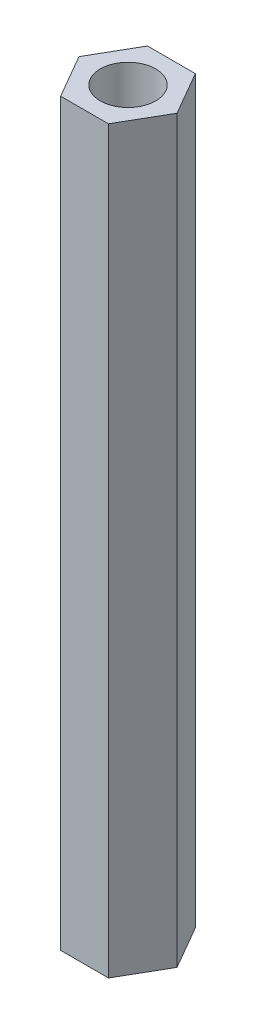
ISO-10303-21;
HEADER;
FILE_DESCRIPTION(('STEP AP214'),'2;1');
FILE_NAME('part.step','',(''),(''),'','','');
FILE_SCHEMA(('AUTOMOTIVE_DESIGN { 1 0 10303 214 1 1 1 1 }'));
ENDSEC;
DATA;
#1=APPLICATION_CONTEXT('core data for automotive mechanical design processes');
#2=APPLICATION_PROTOCOL_DEFINITION('international standard','automotive_design',2000,#1);
#3=PRODUCT_CONTEXT('',#1,'mechanical');
#4=PRODUCT('Part','Part','',(#3));
#5=PRODUCT_RELATED_PRODUCT_CATEGORY('part','',(#4));
#6=PRODUCT_DEFINITION_FORMATION('','',#4);
#7=PRODUCT_DEFINITION_CONTEXT('part definition',#1,'design');
#8=PRODUCT_DEFINITION('design','',#6,#7);
#9=PRODUCT_DEFINITION_SHAPE('','',#8);
#10=(LENGTH_UNIT() NAMED_UNIT(*) SI_UNIT(.MILLI.,.METRE.));
#11=(NAMED_UNIT(*) PLANE_ANGLE_UNIT() SI_UNIT($,.RADIAN.));
#12=(NAMED_UNIT(*) SI_UNIT($,.STERADIAN.) SOLID_ANGLE_UNIT());
#13=UNCERTAINTY_MEASURE_WITH_UNIT(LENGTH_MEASURE(1.E-05),#10,'distance_accuracy_value','');
#14=(GEOMETRIC_REPRESENTATION_CONTEXT(3) GLOBAL_UNCERTAINTY_ASSIGNED_CONTEXT((#13)) GLOBAL_UNIT_ASSIGNED_CONTEXT((#10,
#11,#12)) REPRESENTATION_CONTEXT('',''));
#15=CARTESIAN_POINT('',(0.,0.,0.));
#16=DIRECTION('',(0.,0.,1.));
#17=DIRECTION('',(1.,0.,0.));
#18=AXIS2_PLACEMENT_3D('',#15,#16,#17);
#19=CARTESIAN_POINT('',(0.,40.,0.));
#20=DIRECTION('',(0.,1.,0.));
#21=DIRECTION('',(0.,0.,1.));
#22=AXIS2_PLACEMENT_3D('',#19,#20,#21);
#23=PLANE('',#22);
#24=DIRECTION('',(0.499999999999998,0.,0.86602540378444));
#25=VECTOR('',#24,1.);
#26=CARTESIAN_POINT('',(-1.29322686740439,40.,2.35));
#27=LINE('',#26,#25);
#28=CARTESIAN_POINT('',(-2.65,40.,0.));
#29=VERTEX_POINT('',#28);
#30=CARTESIAN_POINT('',(-1.29322686740439,40.,2.35));
#31=VERTEX_POINT('',#30);
#32=EDGE_CURVE('E146',#29,#31,#27,.T.);
#33=ORIENTED_EDGE('',*,*,#32,.T.);
#34=DIRECTION('',(1.,0.,0.));
#35=VECTOR('',#34,1.);
#36=CARTESIAN_POINT('',(1.29322686740439,40.,2.35));
#37=LINE('',#36,#35);
#38=CARTESIAN_POINT('',(1.29322686740439,40.,2.35));
#39=VERTEX_POINT('',#38);
#40=EDGE_CURVE('E94',#31,#39,#37,.T.);
#41=ORIENTED_EDGE('',*,*,#40,.T.);
#42=DIRECTION('',(0.499999999999998,0.,-0.86602540378444));
#43=VECTOR('',#42,1.);
#44=CARTESIAN_POINT('',(1.29322686740439,40.,2.35));
#45=LINE('',#44,#43);
#46=CARTESIAN_POINT('',(2.65,40.,0.));
#47=VERTEX_POINT('',#46);
#48=EDGE_CURVE('E107',#39,#47,#45,.T.);
#49=ORIENTED_EDGE('',*,*,#48,.T.);
#50=DIRECTION('',(-0.499999999999998,0.,-0.86602540378444));
#51=VECTOR('',#50,1.);
#52=CARTESIAN_POINT('',(1.29322686740439,40.,-2.35));
#53=LINE('',#52,#51);
#54=CARTESIAN_POINT('',(1.29322686740439,40.,-2.35));
#55=VERTEX_POINT('',#54);
#56=EDGE_CURVE('E101',#47,#55,#53,.T.);
#57=ORIENTED_EDGE('',*,*,#56,.T.);
#58=DIRECTION('',(-1.,0.,0.));
#59=VECTOR('',#58,1.);
#60=CARTESIAN_POINT('',(1.29322686740439,40.,-2.35));
#61=LINE('',#60,#59);
#62=CARTESIAN_POINT('',(-1.29322686740439,40.,-2.35));
#63=VERTEX_POINT('',#62);
#64=EDGE_CURVE('E105',#55,#63,#61,.T.);
#65=ORIENTED_EDGE('',*,*,#64,.T.);
#66=DIRECTION('',(-0.499999999999998,0.,0.86602540378444));
#67=VECTOR('',#66,1.);
#68=CARTESIAN_POINT('',(-1.29322686740439,40.,-2.35));
#69=LINE('',#68,#67);
#70=EDGE_CURVE('E57',#63,#29,#69,.T.);
#71=ORIENTED_EDGE('',*,*,#70,.T.);
#72=EDGE_LOOP('',(#33,#41,#49,#57,#65,#71));
#73=FACE_BOUND('',#72,.T.);
#74=CARTESIAN_POINT('',(0.,40.,0.));
#75=DIRECTION('',(0.,1.,0.));
#76=DIRECTION('',(0.,0.,1.));
#77=AXIS2_PLACEMENT_3D('',#74,#75,#76);
#78=CIRCLE('',#77,1.5);
#79=CARTESIAN_POINT('',(0.,40.,1.5));
#80=VERTEX_POINT('',#79);
#81=EDGE_CURVE('E134',#80,#80,#78,.T.);
#82=ORIENTED_EDGE('',*,*,#81,.F.);
#83=EDGE_LOOP('',(#82));
#84=FACE_BOUND('',#83,.T.);
#85=ADVANCED_FACE('F39',(#73,#84),#23,.T.);
#86=CARTESIAN_POINT('',(0.,0.,0.));
#87=DIRECTION('',(0.,1.,0.));
#88=DIRECTION('',(0.,0.,1.));
#89=AXIS2_PLACEMENT_3D('',#86,#87,#88);
#90=PLANE('',#89);
#91=DIRECTION('',(0.499999999999998,0.,0.86602540378444));
#92=VECTOR('',#91,1.);
#93=CARTESIAN_POINT('',(-1.29322686740439,0.,2.35));
#94=LINE('',#93,#92);
#95=CARTESIAN_POINT('',(-2.65,0.,0.));
#96=VERTEX_POINT('',#95);
#97=CARTESIAN_POINT('',(-1.29322686740439,0.,2.35));
#98=VERTEX_POINT('',#97);
#99=EDGE_CURVE('E129',#96,#98,#94,.T.);
#100=ORIENTED_EDGE('',*,*,#99,.F.);
#101=DIRECTION('',(-0.499999999999998,0.,0.86602540378444));
#102=VECTOR('',#101,1.);
#103=CARTESIAN_POINT('',(-1.29322686740439,0.,-2.35));
#104=LINE('',#103,#102);
#105=CARTESIAN_POINT('',(-1.29322686740439,0.,-2.35));
#106=VERTEX_POINT('',#105);
#107=EDGE_CURVE('E86',#106,#96,#104,.T.);
#108=ORIENTED_EDGE('',*,*,#107,.F.);
#109=DIRECTION('',(-1.,0.,0.));
#110=VECTOR('',#109,1.);
#111=CARTESIAN_POINT('',(1.29322686740439,0.,-2.35));
#112=LINE('',#111,#110);
#113=CARTESIAN_POINT('',(1.29322686740439,0.,-2.35));
#114=VERTEX_POINT('',#113);
#115=EDGE_CURVE('E80',#114,#106,#112,.T.);
#116=ORIENTED_EDGE('',*,*,#115,.F.);
#117=DIRECTION('',(-0.499999999999998,0.,-0.86602540378444));
#118=VECTOR('',#117,1.);
#119=CARTESIAN_POINT('',(1.29322686740439,0.,-2.35));
#120=LINE('',#119,#118);
#121=CARTESIAN_POINT('',(2.65,0.,0.));
#122=VERTEX_POINT('',#121);
#123=EDGE_CURVE('E116',#122,#114,#120,.T.);
#124=ORIENTED_EDGE('',*,*,#123,.F.);
#125=DIRECTION('',(0.499999999999998,0.,-0.86602540378444));
#126=VECTOR('',#125,1.);
#127=CARTESIAN_POINT('',(1.29322686740439,0.,2.35));
#128=LINE('',#127,#126);
#129=CARTESIAN_POINT('',(1.29322686740439,0.,2.35));
#130=VERTEX_POINT('',#129);
#131=EDGE_CURVE('E137',#130,#122,#128,.T.);
#132=ORIENTED_EDGE('',*,*,#131,.F.);
#133=DIRECTION('',(1.,0.,0.));
#134=VECTOR('',#133,1.);
#135=CARTESIAN_POINT('',(1.29322686740439,0.,2.35));
#136=LINE('',#135,#134);
#137=EDGE_CURVE('E133',#98,#130,#136,.T.);
#138=ORIENTED_EDGE('',*,*,#137,.F.);
#139=EDGE_LOOP('',(#100,#108,#116,#124,#132,#138));
#140=FACE_BOUND('',#139,.T.);
#141=CARTESIAN_POINT('',(0.,0.,0.));
#142=DIRECTION('',(0.,1.,0.));
#143=DIRECTION('',(0.,0.,1.));
#144=AXIS2_PLACEMENT_3D('',#141,#142,#143);
#145=CIRCLE('',#144,1.5);
#146=CARTESIAN_POINT('',(0.,0.,1.5));
#147=VERTEX_POINT('',#146);
#148=EDGE_CURVE('E243',#147,#147,#145,.T.);
#149=ORIENTED_EDGE('',*,*,#148,.T.);
#150=EDGE_LOOP('',(#149));
#151=FACE_BOUND('',#150,.T.);
#152=ADVANCED_FACE('F159',(#140,#151),#90,.F.);
#153=CARTESIAN_POINT('',(-1.29322686740439,40.,2.35));
#154=DIRECTION('',(0.86602540378444,0.,-0.499999999999998));
#155=DIRECTION('',(-0.499999999999998,0.,-0.86602540378444));
#156=AXIS2_PLACEMENT_3D('',#153,#154,#155);
#157=PLANE('',#156);
#158=ORIENTED_EDGE('',*,*,#99,.T.);
#159=DIRECTION('',(0.,-1.,0.));
#160=VECTOR('',#159,1.);
#161=CARTESIAN_POINT('',(-1.29322686740439,40.,2.35));
#162=LINE('',#161,#160);
#163=EDGE_CURVE('E11',#31,#98,#162,.T.);
#164=ORIENTED_EDGE('',*,*,#163,.F.);
#165=ORIENTED_EDGE('',*,*,#32,.F.);
#166=DIRECTION('',(0.,-1.,0.));
#167=VECTOR('',#166,1.);
#168=CARTESIAN_POINT('',(-2.65,40.,0.));
#169=LINE('',#168,#167);
#170=EDGE_CURVE('E125',#29,#96,#169,.T.);
#171=ORIENTED_EDGE('',*,*,#170,.T.);
#172=EDGE_LOOP('',(#158,#164,#165,#171));
#173=FACE_BOUND('',#172,.T.);
#174=ADVANCED_FACE('F41',(#173),#157,.F.);
#175=CARTESIAN_POINT('',(1.29322686740439,40.,2.35));
#176=DIRECTION('',(0.,0.,-1.));
#177=DIRECTION('',(-1.,0.,0.));
#178=AXIS2_PLACEMENT_3D('',#175,#176,#177);
#179=PLANE('',#178);
#180=ORIENTED_EDGE('',*,*,#137,.T.);
#181=DIRECTION('',(0.,-1.,0.));
#182=VECTOR('',#181,1.);
#183=CARTESIAN_POINT('',(1.29322686740439,40.,2.35));
#184=LINE('',#183,#182);
#185=EDGE_CURVE('E49',#39,#130,#184,.T.);
#186=ORIENTED_EDGE('',*,*,#185,.F.);
#187=ORIENTED_EDGE('',*,*,#40,.F.);
#188=ORIENTED_EDGE('',*,*,#163,.T.);
#189=EDGE_LOOP('',(#180,#186,#187,#188));
#190=FACE_BOUND('',#189,.T.);
#191=ADVANCED_FACE('F184',(#190),#179,.F.);
#192=CARTESIAN_POINT('',(1.29322686740439,40.,2.35));
#193=DIRECTION('',(-0.86602540378444,0.,-0.499999999999998));
#194=DIRECTION('',(-0.499999999999998,0.,0.86602540378444));
#195=AXIS2_PLACEMENT_3D('',#192,#193,#194);
#196=PLANE('',#195);
#197=ORIENTED_EDGE('',*,*,#131,.T.);
#198=DIRECTION('',(0.,-1.,0.));
#199=VECTOR('',#198,1.);
#200=CARTESIAN_POINT('',(2.65,40.,0.));
#201=LINE('',#200,#199);
#202=EDGE_CURVE('E118',#47,#122,#201,.T.);
#203=ORIENTED_EDGE('',*,*,#202,.F.);
#204=ORIENTED_EDGE('',*,*,#48,.F.);
#205=ORIENTED_EDGE('',*,*,#185,.T.);
#206=EDGE_LOOP('',(#197,#203,#204,#205));
#207=FACE_BOUND('',#206,.T.);
#208=ADVANCED_FACE('F156',(#207),#196,.F.);
#209=CARTESIAN_POINT('',(1.29322686740439,40.,-2.35));
#210=DIRECTION('',(-0.86602540378444,0.,0.499999999999998));
#211=DIRECTION('',(0.499999999999998,0.,0.86602540378444));
#212=AXIS2_PLACEMENT_3D('',#209,#210,#211);
#213=PLANE('',#212);
#214=ORIENTED_EDGE('',*,*,#123,.T.);
#215=DIRECTION('',(0.,-1.,0.));
#216=VECTOR('',#215,1.);
#217=CARTESIAN_POINT('',(1.29322686740439,40.,-2.35));
#218=LINE('',#217,#216);
#219=EDGE_CURVE('E113',#55,#114,#218,.T.);
#220=ORIENTED_EDGE('',*,*,#219,.F.);
#221=ORIENTED_EDGE('',*,*,#56,.F.);
#222=ORIENTED_EDGE('',*,*,#202,.T.);
#223=EDGE_LOOP('',(#214,#220,#221,#222));
#224=FACE_BOUND('',#223,.T.);
#225=ADVANCED_FACE('F114',(#224),#213,.F.);
#226=CARTESIAN_POINT('',(1.29322686740439,40.,-2.35));
#227=DIRECTION('',(0.,0.,1.));
#228=DIRECTION('',(1.,0.,0.));
#229=AXIS2_PLACEMENT_3D('',#226,#227,#228);
#230=PLANE('',#229);
#231=ORIENTED_EDGE('',*,*,#115,.T.);
#232=DIRECTION('',(0.,-1.,0.));
#233=VECTOR('',#232,1.);
#234=CARTESIAN_POINT('',(-1.29322686740439,40.,-2.35));
#235=LINE('',#234,#233);
#236=EDGE_CURVE('E119',#63,#106,#235,.T.);
#237=ORIENTED_EDGE('',*,*,#236,.F.);
#238=ORIENTED_EDGE('',*,*,#64,.F.);
#239=ORIENTED_EDGE('',*,*,#219,.T.);
#240=EDGE_LOOP('',(#231,#237,#238,#239));
#241=FACE_BOUND('',#240,.T.);
#242=ADVANCED_FACE('F121',(#241),#230,.F.);
#243=CARTESIAN_POINT('',(-1.29322686740439,40.,-2.35));
#244=DIRECTION('',(0.86602540378444,0.,0.499999999999998));
#245=DIRECTION('',(0.499999999999998,0.,-0.86602540378444));
#246=AXIS2_PLACEMENT_3D('',#243,#244,#245);
#247=PLANE('',#246);
#248=ORIENTED_EDGE('',*,*,#107,.T.);
#249=ORIENTED_EDGE('',*,*,#170,.F.);
#250=ORIENTED_EDGE('',*,*,#70,.F.);
#251=ORIENTED_EDGE('',*,*,#236,.T.);
#252=EDGE_LOOP('',(#248,#249,#250,#251));
#253=FACE_BOUND('',#252,.T.);
#254=ADVANCED_FACE('F164',(#253),#247,.F.);
#255=CARTESIAN_POINT('',(0.,40.,0.));
#256=DIRECTION('',(0.,-1.,0.));
#257=DIRECTION('',(0.,0.,-1.));
#258=AXIS2_PLACEMENT_3D('',#255,#256,#257);
#259=CYLINDRICAL_SURFACE('',#258,1.5);
#260=ORIENTED_EDGE('',*,*,#81,.T.);
#261=EDGE_LOOP('',(#260));
#262=FACE_BOUND('',#261,.T.);
#263=ORIENTED_EDGE('',*,*,#148,.F.);
#264=EDGE_LOOP('',(#263));
#265=FACE_BOUND('',#264,.T.);
#266=ADVANCED_FACE('F166',(#262,#265),#259,.F.);
#267=CLOSED_SHELL('',(#85,#152,#174,#191,#208,#225,#242,#254,#266));
#268=MANIFOLD_SOLID_BREP('B2',#267);
#269=ADVANCED_BREP_SHAPE_REPRESENTATION('',(#18,#268),#14);
#270=SHAPE_DEFINITION_REPRESENTATION(#9,#269);
ENDSEC;
END-ISO-10303-21;
